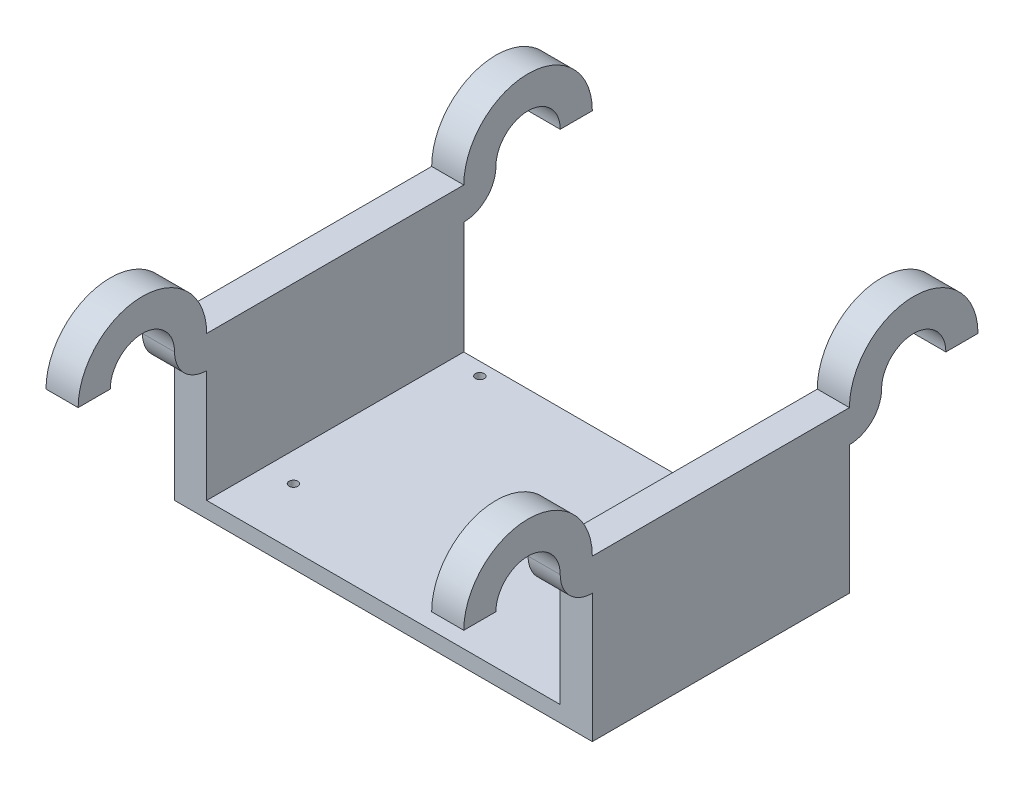
ISO-10303-21;
HEADER;
FILE_DESCRIPTION(('STEP AP214'),'2;1');
FILE_NAME('part.step','',(''),(''),'','','');
FILE_SCHEMA(('AUTOMOTIVE_DESIGN { 1 0 10303 214 1 1 1 1 }'));
ENDSEC;
DATA;
#1=APPLICATION_CONTEXT('core data for automotive mechanical design processes');
#2=APPLICATION_PROTOCOL_DEFINITION('international standard','automotive_design',2000,#1);
#3=PRODUCT_CONTEXT('',#1,'mechanical');
#4=PRODUCT('Part','Part','',(#3));
#5=PRODUCT_RELATED_PRODUCT_CATEGORY('part','',(#4));
#6=PRODUCT_DEFINITION_FORMATION('','',#4);
#7=PRODUCT_DEFINITION_CONTEXT('part definition',#1,'design');
#8=PRODUCT_DEFINITION('design','',#6,#7);
#9=PRODUCT_DEFINITION_SHAPE('','',#8);
#10=(LENGTH_UNIT() NAMED_UNIT(*) SI_UNIT(.MILLI.,.METRE.));
#11=(NAMED_UNIT(*) PLANE_ANGLE_UNIT() SI_UNIT($,.RADIAN.));
#12=(NAMED_UNIT(*) SI_UNIT($,.STERADIAN.) SOLID_ANGLE_UNIT());
#13=UNCERTAINTY_MEASURE_WITH_UNIT(LENGTH_MEASURE(1.E-05),#10,'distance_accuracy_value','');
#14=(GEOMETRIC_REPRESENTATION_CONTEXT(3) GLOBAL_UNCERTAINTY_ASSIGNED_CONTEXT((#13)) GLOBAL_UNIT_ASSIGNED_CONTEXT((#10,
#11,#12)) REPRESENTATION_CONTEXT('',''));
#15=CARTESIAN_POINT('',(0.,0.,0.));
#16=DIRECTION('',(0.,0.,1.));
#17=DIRECTION('',(1.,0.,0.));
#18=AXIS2_PLACEMENT_3D('',#15,#16,#17);
#19=CARTESIAN_POINT('',(-65.,5.,40.));
#20=DIRECTION('',(0.,0.,-1.));
#21=DIRECTION('',(-1.,0.,0.));
#22=AXIS2_PLACEMENT_3D('',#19,#20,#21);
#23=PLANE('',#22);
#24=DIRECTION('',(0.,-1.,0.));
#25=VECTOR('',#24,1.);
#26=CARTESIAN_POINT('',(65.,5.,40.));
#27=LINE('',#26,#25);
#28=CARTESIAN_POINT('',(65.,40.,40.));
#29=VERTEX_POINT('',#28);
#30=CARTESIAN_POINT('',(65.,0.,40.));
#31=VERTEX_POINT('',#30);
#32=EDGE_CURVE('E395',#29,#31,#27,.T.);
#33=ORIENTED_EDGE('',*,*,#32,.F.);
#34=DIRECTION('',(1.,0.,0.));
#35=VECTOR('',#34,1.);
#36=CARTESIAN_POINT('',(5.00000000000003,40.,40.));
#37=LINE('',#36,#35);
#38=CARTESIAN_POINT('',(55.,40.,40.));
#39=VERTEX_POINT('',#38);
#40=EDGE_CURVE('E268',#39,#29,#37,.T.);
#41=ORIENTED_EDGE('',*,*,#40,.F.);
#42=DIRECTION('',(0.,-1.,0.));
#43=VECTOR('',#42,1.);
#44=CARTESIAN_POINT('',(55.,50.,40.));
#45=LINE('',#44,#43);
#46=CARTESIAN_POINT('',(55.,5.,40.));
#47=VERTEX_POINT('',#46);
#48=EDGE_CURVE('E384',#39,#47,#45,.T.);
#49=ORIENTED_EDGE('',*,*,#48,.T.);
#50=DIRECTION('',(1.,0.,0.));
#51=VECTOR('',#50,1.);
#52=CARTESIAN_POINT('',(-65.,5.,40.));
#53=LINE('',#52,#51);
#54=CARTESIAN_POINT('',(-55.,5.,40.));
#55=VERTEX_POINT('',#54);
#56=EDGE_CURVE('E391',#55,#47,#53,.T.);
#57=ORIENTED_EDGE('',*,*,#56,.F.);
#58=DIRECTION('',(0.,-1.,0.));
#59=VECTOR('',#58,1.);
#60=CARTESIAN_POINT('',(-55.,50.,40.));
#61=LINE('',#60,#59);
#62=CARTESIAN_POINT('',(-55.,40.,40.));
#63=VERTEX_POINT('',#62);
#64=EDGE_CURVE('E372',#63,#55,#61,.T.);
#65=ORIENTED_EDGE('',*,*,#64,.F.);
#66=DIRECTION('',(-1.,0.,0.));
#67=VECTOR('',#66,1.);
#68=CARTESIAN_POINT('',(-5.,40.,40.));
#69=LINE('',#68,#67);
#70=CARTESIAN_POINT('',(-65.,40.,40.));
#71=VERTEX_POINT('',#70);
#72=EDGE_CURVE('E296',#63,#71,#69,.T.);
#73=ORIENTED_EDGE('',*,*,#72,.T.);
#74=DIRECTION('',(0.,-1.,0.));
#75=VECTOR('',#74,1.);
#76=CARTESIAN_POINT('',(-65.,5.,40.));
#77=LINE('',#76,#75);
#78=CARTESIAN_POINT('',(-65.,0.,40.));
#79=VERTEX_POINT('',#78);
#80=EDGE_CURVE('E406',#71,#79,#77,.T.);
#81=ORIENTED_EDGE('',*,*,#80,.T.);
#82=DIRECTION('',(1.,0.,0.));
#83=VECTOR('',#82,1.);
#84=CARTESIAN_POINT('',(-65.,0.,40.));
#85=LINE('',#84,#83);
#86=EDGE_CURVE('E392',#79,#31,#85,.T.);
#87=ORIENTED_EDGE('',*,*,#86,.T.);
#88=EDGE_LOOP('',(#33,#41,#49,#57,#65,#73,#81,#87));
#89=FACE_BOUND('',#88,.T.);
#90=ADVANCED_FACE('F39',(#89),#23,.F.);
#91=CARTESIAN_POINT('',(0.,5.,0.));
#92=DIRECTION('',(0.,-1.,0.));
#93=DIRECTION('',(0.,0.,-1.));
#94=AXIS2_PLACEMENT_3D('',#91,#92,#93);
#95=PLANE('',#94);
#96=CARTESIAN_POINT('',(40.,5.,22.));
#97=DIRECTION('',(0.,-1.,0.));
#98=DIRECTION('',(0.,0.,-1.));
#99=AXIS2_PLACEMENT_3D('',#96,#97,#98);
#100=CIRCLE('',#99,1.375);
#101=CARTESIAN_POINT('',(40.,5.,20.625));
#102=VERTEX_POINT('',#101);
#103=EDGE_CURVE('E347',#102,#102,#100,.T.);
#104=ORIENTED_EDGE('',*,*,#103,.T.);
#105=EDGE_LOOP('',(#104));
#106=FACE_BOUND('',#105,.T.);
#107=CARTESIAN_POINT('',(40.,5.,-36.));
#108=DIRECTION('',(0.,-1.,0.));
#109=DIRECTION('',(0.,0.,-1.));
#110=AXIS2_PLACEMENT_3D('',#107,#108,#109);
#111=CIRCLE('',#110,1.375);
#112=CARTESIAN_POINT('',(40.,5.,-37.375));
#113=VERTEX_POINT('',#112);
#114=EDGE_CURVE('E344',#113,#113,#111,.T.);
#115=ORIENTED_EDGE('',*,*,#114,.T.);
#116=EDGE_LOOP('',(#115));
#117=FACE_BOUND('',#116,.T.);
#118=CARTESIAN_POINT('',(-46.,5.,-36.));
#119=DIRECTION('',(0.,-1.,0.));
#120=DIRECTION('',(0.,0.,-1.));
#121=AXIS2_PLACEMENT_3D('',#118,#119,#120);
#122=CIRCLE('',#121,1.375);
#123=CARTESIAN_POINT('',(-46.,5.,-37.375));
#124=VERTEX_POINT('',#123);
#125=EDGE_CURVE('E336',#124,#124,#122,.T.);
#126=ORIENTED_EDGE('',*,*,#125,.T.);
#127=EDGE_LOOP('',(#126));
#128=FACE_BOUND('',#127,.T.);
#129=CARTESIAN_POINT('',(-46.,5.,22.));
#130=DIRECTION('',(0.,-1.,0.));
#131=DIRECTION('',(0.,0.,-1.));
#132=AXIS2_PLACEMENT_3D('',#129,#130,#131);
#133=CIRCLE('',#132,1.375);
#134=CARTESIAN_POINT('',(-46.,5.,20.625));
#135=VERTEX_POINT('',#134);
#136=EDGE_CURVE('E353',#135,#135,#133,.T.);
#137=ORIENTED_EDGE('',*,*,#136,.T.);
#138=EDGE_LOOP('',(#137));
#139=FACE_BOUND('',#138,.T.);
#140=DIRECTION('',(0.,0.,-1.));
#141=VECTOR('',#140,1.);
#142=CARTESIAN_POINT('',(-55.,5.,40.));
#143=LINE('',#142,#141);
#144=CARTESIAN_POINT('',(-55.,5.,-40.));
#145=VERTEX_POINT('',#144);
#146=EDGE_CURVE('E356',#55,#145,#143,.T.);
#147=ORIENTED_EDGE('',*,*,#146,.F.);
#148=ORIENTED_EDGE('',*,*,#56,.T.);
#149=DIRECTION('',(0.,0.,1.));
#150=VECTOR('',#149,1.);
#151=CARTESIAN_POINT('',(55.,5.,-40.));
#152=LINE('',#151,#150);
#153=CARTESIAN_POINT('',(55.,5.,-40.));
#154=VERTEX_POINT('',#153);
#155=EDGE_CURVE('E374',#154,#47,#152,.T.);
#156=ORIENTED_EDGE('',*,*,#155,.F.);
#157=DIRECTION('',(-1.,0.,0.));
#158=VECTOR('',#157,1.);
#159=CARTESIAN_POINT('',(-65.,5.,-40.));
#160=LINE('',#159,#158);
#161=EDGE_CURVE('E389',#154,#145,#160,.T.);
#162=ORIENTED_EDGE('',*,*,#161,.T.);
#163=EDGE_LOOP('',(#147,#148,#156,#162));
#164=FACE_BOUND('',#163,.T.);
#165=ADVANCED_FACE('F465',(#106,#117,#128,#139,#164),#95,.F.);
#166=CARTESIAN_POINT('',(65.,5.,40.));
#167=DIRECTION('',(-1.,0.,0.));
#168=DIRECTION('',(0.,0.,1.));
#169=AXIS2_PLACEMENT_3D('',#166,#167,#168);
#170=PLANE('',#169);
#171=DIRECTION('',(0.,0.,-1.));
#172=VECTOR('',#171,1.);
#173=CARTESIAN_POINT('',(65.,0.,40.));
#174=LINE('',#173,#172);
#175=CARTESIAN_POINT('',(65.,0.,-40.));
#176=VERTEX_POINT('',#175);
#177=EDGE_CURVE('E388',#31,#176,#174,.T.);
#178=ORIENTED_EDGE('',*,*,#177,.T.);
#179=DIRECTION('',(0.,-1.,0.));
#180=VECTOR('',#179,1.);
#181=CARTESIAN_POINT('',(65.,5.,-40.));
#182=LINE('',#181,#180);
#183=CARTESIAN_POINT('',(65.,40.,-40.));
#184=VERTEX_POINT('',#183);
#185=EDGE_CURVE('E11',#184,#176,#182,.T.);
#186=ORIENTED_EDGE('',*,*,#185,.F.);
#187=CARTESIAN_POINT('',(65.,50.,-40.));
#188=DIRECTION('',(1.,0.,0.));
#189=DIRECTION('',(0.,0.,-1.));
#190=AXIS2_PLACEMENT_3D('',#187,#188,#189);
#191=CIRCLE('',#190,9.99999999999999);
#192=CARTESIAN_POINT('',(65.,50.,-50.));
#193=VERTEX_POINT('',#192);
#194=EDGE_CURVE('E222',#184,#193,#191,.T.);
#195=ORIENTED_EDGE('',*,*,#194,.T.);
#196=CARTESIAN_POINT('',(65.,50.,-60.));
#197=DIRECTION('',(1.,0.,0.));
#198=DIRECTION('',(0.,0.,-1.));
#199=AXIS2_PLACEMENT_3D('',#196,#197,#198);
#200=CIRCLE('',#199,10.);
#201=CARTESIAN_POINT('',(65.,50.,-70.));
#202=VERTEX_POINT('',#201);
#203=EDGE_CURVE('E212',#202,#193,#200,.T.);
#204=ORIENTED_EDGE('',*,*,#203,.F.);
#205=DIRECTION('',(0.,0.,-1.));
#206=VECTOR('',#205,1.);
#207=CARTESIAN_POINT('',(65.,50.,0.));
#208=LINE('',#207,#206);
#209=CARTESIAN_POINT('',(65.,50.,-80.));
#210=VERTEX_POINT('',#209);
#211=EDGE_CURVE('E208',#202,#210,#208,.T.);
#212=ORIENTED_EDGE('',*,*,#211,.T.);
#213=CARTESIAN_POINT('',(65.,50.,-60.));
#214=DIRECTION('',(1.,0.,0.));
#215=DIRECTION('',(0.,0.,-1.));
#216=AXIS2_PLACEMENT_3D('',#213,#214,#215);
#217=CIRCLE('',#216,20.);
#218=CARTESIAN_POINT('',(65.,50.,-40.));
#219=VERTEX_POINT('',#218);
#220=EDGE_CURVE('E215',#210,#219,#217,.T.);
#221=ORIENTED_EDGE('',*,*,#220,.T.);
#222=DIRECTION('',(0.,0.,-1.));
#223=VECTOR('',#222,1.);
#224=CARTESIAN_POINT('',(65.,50.,-40.));
#225=LINE('',#224,#223);
#226=CARTESIAN_POINT('',(65.,50.,40.));
#227=VERTEX_POINT('',#226);
#228=EDGE_CURVE('E375',#227,#219,#225,.T.);
#229=ORIENTED_EDGE('',*,*,#228,.F.);
#230=CARTESIAN_POINT('',(65.,50.,60.));
#231=DIRECTION('',(1.,0.,0.));
#232=DIRECTION('',(0.,0.,-1.));
#233=AXIS2_PLACEMENT_3D('',#230,#231,#232);
#234=CIRCLE('',#233,20.);
#235=CARTESIAN_POINT('',(65.,50.,80.));
#236=VERTEX_POINT('',#235);
#237=EDGE_CURVE('E258',#227,#236,#234,.T.);
#238=ORIENTED_EDGE('',*,*,#237,.T.);
#239=DIRECTION('',(0.,0.,-1.));
#240=VECTOR('',#239,1.);
#241=CARTESIAN_POINT('',(65.,50.,0.));
#242=LINE('',#241,#240);
#243=CARTESIAN_POINT('',(65.,50.,70.));
#244=VERTEX_POINT('',#243);
#245=EDGE_CURVE('E261',#236,#244,#242,.T.);
#246=ORIENTED_EDGE('',*,*,#245,.T.);
#247=CARTESIAN_POINT('',(65.,50.,60.));
#248=DIRECTION('',(1.,0.,0.));
#249=DIRECTION('',(0.,0.,-1.));
#250=AXIS2_PLACEMENT_3D('',#247,#248,#249);
#251=CIRCLE('',#250,10.);
#252=CARTESIAN_POINT('',(65.,50.,50.));
#253=VERTEX_POINT('',#252);
#254=EDGE_CURVE('E243',#253,#244,#251,.T.);
#255=ORIENTED_EDGE('',*,*,#254,.F.);
#256=CARTESIAN_POINT('',(65.,50.,40.));
#257=DIRECTION('',(1.,0.,0.));
#258=DIRECTION('',(0.,0.,-1.));
#259=AXIS2_PLACEMENT_3D('',#256,#257,#258);
#260=CIRCLE('',#259,9.99999999999999);
#261=EDGE_CURVE('E255',#253,#29,#260,.T.);
#262=ORIENTED_EDGE('',*,*,#261,.T.);
#263=ORIENTED_EDGE('',*,*,#32,.T.);
#264=EDGE_LOOP('',(#178,#186,#195,#204,#212,#221,#229,#238,#246,#255,#262,#263));
#265=FACE_BOUND('',#264,.T.);
#266=ADVANCED_FACE('F41',(#265),#170,.F.);
#267=CARTESIAN_POINT('',(-65.,5.,-40.));
#268=DIRECTION('',(0.,0.,1.));
#269=DIRECTION('',(1.,0.,0.));
#270=AXIS2_PLACEMENT_3D('',#267,#268,#269);
#271=PLANE('',#270);
#272=DIRECTION('',(0.,-1.,0.));
#273=VECTOR('',#272,1.);
#274=CARTESIAN_POINT('',(55.,50.,-40.));
#275=LINE('',#274,#273);
#276=CARTESIAN_POINT('',(55.,40.,-40.));
#277=VERTEX_POINT('',#276);
#278=EDGE_CURVE('E62',#277,#154,#275,.T.);
#279=ORIENTED_EDGE('',*,*,#278,.F.);
#280=DIRECTION('',(1.,0.,0.));
#281=VECTOR('',#280,1.);
#282=CARTESIAN_POINT('',(5.00000000000003,40.,-40.));
#283=LINE('',#282,#281);
#284=EDGE_CURVE('E211',#277,#184,#283,.T.);
#285=ORIENTED_EDGE('',*,*,#284,.T.);
#286=ORIENTED_EDGE('',*,*,#185,.T.);
#287=DIRECTION('',(-1.,0.,0.));
#288=VECTOR('',#287,1.);
#289=CARTESIAN_POINT('',(-65.,0.,-40.));
#290=LINE('',#289,#288);
#291=CARTESIAN_POINT('',(-65.,0.,-40.));
#292=VERTEX_POINT('',#291);
#293=EDGE_CURVE('E397',#176,#292,#290,.T.);
#294=ORIENTED_EDGE('',*,*,#293,.T.);
#295=DIRECTION('',(0.,-1.,0.));
#296=VECTOR('',#295,1.);
#297=CARTESIAN_POINT('',(-65.,5.,-40.));
#298=LINE('',#297,#296);
#299=CARTESIAN_POINT('',(-65.,40.,-40.));
#300=VERTEX_POINT('',#299);
#301=EDGE_CURVE('E47',#300,#292,#298,.T.);
#302=ORIENTED_EDGE('',*,*,#301,.F.);
#303=DIRECTION('',(-1.,0.,0.));
#304=VECTOR('',#303,1.);
#305=CARTESIAN_POINT('',(-5.,40.,-40.));
#306=LINE('',#305,#304);
#307=CARTESIAN_POINT('',(-55.,40.,-40.));
#308=VERTEX_POINT('',#307);
#309=EDGE_CURVE('E328',#308,#300,#306,.T.);
#310=ORIENTED_EDGE('',*,*,#309,.F.);
#311=DIRECTION('',(0.,-1.,0.));
#312=VECTOR('',#311,1.);
#313=CARTESIAN_POINT('',(-55.,50.,-40.));
#314=LINE('',#313,#312);
#315=EDGE_CURVE('E54',#308,#145,#314,.T.);
#316=ORIENTED_EDGE('',*,*,#315,.T.);
#317=ORIENTED_EDGE('',*,*,#161,.F.);
#318=EDGE_LOOP('',(#279,#285,#286,#294,#302,#310,#316,#317));
#319=FACE_BOUND('',#318,.T.);
#320=ADVANCED_FACE('F416',(#319),#271,.F.);
#321=CARTESIAN_POINT('',(-65.,5.,40.));
#322=DIRECTION('',(1.,0.,0.));
#323=DIRECTION('',(0.,0.,-1.));
#324=AXIS2_PLACEMENT_3D('',#321,#322,#323);
#325=PLANE('',#324);
#326=DIRECTION('',(0.,0.,1.));
#327=VECTOR('',#326,1.);
#328=CARTESIAN_POINT('',(-65.,0.,40.));
#329=LINE('',#328,#327);
#330=EDGE_CURVE('E400',#292,#79,#329,.T.);
#331=ORIENTED_EDGE('',*,*,#330,.T.);
#332=ORIENTED_EDGE('',*,*,#80,.F.);
#333=CARTESIAN_POINT('',(-65.,50.,40.));
#334=DIRECTION('',(-1.,0.,0.));
#335=DIRECTION('',(0.,0.,1.));
#336=AXIS2_PLACEMENT_3D('',#333,#334,#335);
#337=CIRCLE('',#336,9.99999999999999);
#338=CARTESIAN_POINT('',(-65.,50.,50.));
#339=VERTEX_POINT('',#338);
#340=EDGE_CURVE('E288',#339,#71,#337,.F.);
#341=ORIENTED_EDGE('',*,*,#340,.F.);
#342=CARTESIAN_POINT('',(-65.,50.,60.));
#343=DIRECTION('',(-1.,0.,0.));
#344=DIRECTION('',(0.,0.,1.));
#345=AXIS2_PLACEMENT_3D('',#342,#343,#344);
#346=CIRCLE('',#345,10.);
#347=CARTESIAN_POINT('',(-65.,50.,70.));
#348=VERTEX_POINT('',#347);
#349=EDGE_CURVE('E290',#348,#339,#346,.T.);
#350=ORIENTED_EDGE('',*,*,#349,.F.);
#351=DIRECTION('',(0.,0.,-1.));
#352=VECTOR('',#351,1.);
#353=CARTESIAN_POINT('',(-65.,50.,0.));
#354=LINE('',#353,#352);
#355=CARTESIAN_POINT('',(-65.,50.,80.));
#356=VERTEX_POINT('',#355);
#357=EDGE_CURVE('E293',#356,#348,#354,.T.);
#358=ORIENTED_EDGE('',*,*,#357,.F.);
#359=CARTESIAN_POINT('',(-65.,50.,60.));
#360=DIRECTION('',(-1.,0.,0.));
#361=DIRECTION('',(0.,0.,1.));
#362=AXIS2_PLACEMENT_3D('',#359,#360,#361);
#363=CIRCLE('',#362,20.);
#364=CARTESIAN_POINT('',(-65.,50.,40.));
#365=VERTEX_POINT('',#364);
#366=EDGE_CURVE('E272',#365,#356,#363,.F.);
#367=ORIENTED_EDGE('',*,*,#366,.F.);
#368=DIRECTION('',(0.,0.,1.));
#369=VECTOR('',#368,1.);
#370=CARTESIAN_POINT('',(-65.,50.,40.));
#371=LINE('',#370,#369);
#372=CARTESIAN_POINT('',(-65.,50.,-40.));
#373=VERTEX_POINT('',#372);
#374=EDGE_CURVE('E357',#373,#365,#371,.T.);
#375=ORIENTED_EDGE('',*,*,#374,.F.);
#376=CARTESIAN_POINT('',(-65.,50.,-60.));
#377=DIRECTION('',(-1.,0.,0.));
#378=DIRECTION('',(0.,0.,1.));
#379=AXIS2_PLACEMENT_3D('',#376,#377,#378);
#380=CIRCLE('',#379,20.);
#381=CARTESIAN_POINT('',(-65.,50.,-80.));
#382=VERTEX_POINT('',#381);
#383=EDGE_CURVE('E318',#373,#382,#380,.T.);
#384=ORIENTED_EDGE('',*,*,#383,.T.);
#385=DIRECTION('',(0.,0.,1.));
#386=VECTOR('',#385,1.);
#387=CARTESIAN_POINT('',(-65.,50.,0.));
#388=LINE('',#387,#386);
#389=CARTESIAN_POINT('',(-65.,50.,-70.));
#390=VERTEX_POINT('',#389);
#391=EDGE_CURVE('E321',#382,#390,#388,.T.);
#392=ORIENTED_EDGE('',*,*,#391,.T.);
#393=CARTESIAN_POINT('',(-65.,50.,-60.));
#394=DIRECTION('',(-1.,0.,0.));
#395=DIRECTION('',(0.,0.,1.));
#396=AXIS2_PLACEMENT_3D('',#393,#394,#395);
#397=CIRCLE('',#396,10.);
#398=CARTESIAN_POINT('',(-65.,50.,-50.));
#399=VERTEX_POINT('',#398);
#400=EDGE_CURVE('E285',#399,#390,#397,.T.);
#401=ORIENTED_EDGE('',*,*,#400,.F.);
#402=CARTESIAN_POINT('',(-65.,50.,-40.));
#403=DIRECTION('',(-1.,0.,0.));
#404=DIRECTION('',(0.,0.,1.));
#405=AXIS2_PLACEMENT_3D('',#402,#403,#404);
#406=CIRCLE('',#405,9.99999999999999);
#407=EDGE_CURVE('E315',#399,#300,#406,.T.);
#408=ORIENTED_EDGE('',*,*,#407,.T.);
#409=ORIENTED_EDGE('',*,*,#301,.T.);
#410=EDGE_LOOP('',(#331,#332,#341,#350,#358,#367,#375,#384,#392,#401,#408,#409));
#411=FACE_BOUND('',#410,.T.);
#412=ADVANCED_FACE('F409',(#411),#325,.F.);
#413=CARTESIAN_POINT('',(0.,0.,0.));
#414=DIRECTION('',(0.,-1.,0.));
#415=DIRECTION('',(0.,0.,-1.));
#416=AXIS2_PLACEMENT_3D('',#413,#414,#415);
#417=PLANE('',#416);
#418=CARTESIAN_POINT('',(40.,0.,22.));
#419=DIRECTION('',(0.,1.,0.));
#420=DIRECTION('',(0.,0.,1.));
#421=AXIS2_PLACEMENT_3D('',#418,#419,#420);
#422=CIRCLE('',#421,1.375);
#423=CARTESIAN_POINT('',(40.,0.,23.375));
#424=VERTEX_POINT('',#423);
#425=EDGE_CURVE('E333',#424,#424,#422,.T.);
#426=ORIENTED_EDGE('',*,*,#425,.T.);
#427=EDGE_LOOP('',(#426));
#428=FACE_BOUND('',#427,.T.);
#429=CARTESIAN_POINT('',(40.,0.,-36.));
#430=DIRECTION('',(0.,1.,0.));
#431=DIRECTION('',(0.,0.,1.));
#432=AXIS2_PLACEMENT_3D('',#429,#430,#431);
#433=CIRCLE('',#432,1.375);
#434=CARTESIAN_POINT('',(40.,0.,-34.625));
#435=VERTEX_POINT('',#434);
#436=EDGE_CURVE('E337',#435,#435,#433,.T.);
#437=ORIENTED_EDGE('',*,*,#436,.T.);
#438=EDGE_LOOP('',(#437));
#439=FACE_BOUND('',#438,.T.);
#440=CARTESIAN_POINT('',(-46.,0.,-36.));
#441=DIRECTION('',(0.,1.,0.));
#442=DIRECTION('',(0.,0.,1.));
#443=AXIS2_PLACEMENT_3D('',#440,#441,#442);
#444=CIRCLE('',#443,1.375);
#445=CARTESIAN_POINT('',(-46.,0.,-34.625));
#446=VERTEX_POINT('',#445);
#447=EDGE_CURVE('E332',#446,#446,#444,.T.);
#448=ORIENTED_EDGE('',*,*,#447,.T.);
#449=EDGE_LOOP('',(#448));
#450=FACE_BOUND('',#449,.T.);
#451=CARTESIAN_POINT('',(-46.,0.,22.));
#452=DIRECTION('',(0.,1.,0.));
#453=DIRECTION('',(0.,0.,1.));
#454=AXIS2_PLACEMENT_3D('',#451,#452,#453);
#455=CIRCLE('',#454,1.375);
#456=CARTESIAN_POINT('',(-46.,0.,23.375));
#457=VERTEX_POINT('',#456);
#458=EDGE_CURVE('E350',#457,#457,#455,.T.);
#459=ORIENTED_EDGE('',*,*,#458,.T.);
#460=EDGE_LOOP('',(#459));
#461=FACE_BOUND('',#460,.T.);
#462=ORIENTED_EDGE('',*,*,#177,.F.);
#463=ORIENTED_EDGE('',*,*,#86,.F.);
#464=ORIENTED_EDGE('',*,*,#330,.F.);
#465=ORIENTED_EDGE('',*,*,#293,.F.);
#466=EDGE_LOOP('',(#462,#463,#464,#465));
#467=FACE_BOUND('',#466,.T.);
#468=ADVANCED_FACE('F420',(#428,#439,#450,#461,#467),#417,.T.);
#469=CARTESIAN_POINT('',(55.,50.,-40.));
#470=DIRECTION('',(1.,0.,0.));
#471=DIRECTION('',(0.,0.,-1.));
#472=AXIS2_PLACEMENT_3D('',#469,#470,#471);
#473=PLANE('',#472);
#474=ORIENTED_EDGE('',*,*,#155,.T.);
#475=ORIENTED_EDGE('',*,*,#48,.F.);
#476=CARTESIAN_POINT('',(55.,50.,40.));
#477=DIRECTION('',(1.,0.,0.));
#478=DIRECTION('',(0.,0.,-1.));
#479=AXIS2_PLACEMENT_3D('',#476,#477,#478);
#480=CIRCLE('',#479,9.99999999999999);
#481=CARTESIAN_POINT('',(55.,50.,50.));
#482=VERTEX_POINT('',#481);
#483=EDGE_CURVE('E252',#39,#482,#480,.F.);
#484=ORIENTED_EDGE('',*,*,#483,.T.);
#485=CARTESIAN_POINT('',(55.,50.,60.));
#486=DIRECTION('',(1.,0.,0.));
#487=DIRECTION('',(0.,0.,-1.));
#488=AXIS2_PLACEMENT_3D('',#485,#486,#487);
#489=CIRCLE('',#488,10.);
#490=CARTESIAN_POINT('',(55.,50.,70.));
#491=VERTEX_POINT('',#490);
#492=EDGE_CURVE('E249',#491,#482,#489,.F.);
#493=ORIENTED_EDGE('',*,*,#492,.F.);
#494=DIRECTION('',(0.,0.,1.));
#495=VECTOR('',#494,1.);
#496=CARTESIAN_POINT('',(55.,50.,0.));
#497=LINE('',#496,#495);
#498=CARTESIAN_POINT('',(55.,50.,80.));
#499=VERTEX_POINT('',#498);
#500=EDGE_CURVE('E246',#491,#499,#497,.T.);
#501=ORIENTED_EDGE('',*,*,#500,.T.);
#502=CARTESIAN_POINT('',(55.,50.,60.));
#503=DIRECTION('',(1.,0.,0.));
#504=DIRECTION('',(0.,0.,-1.));
#505=AXIS2_PLACEMENT_3D('',#502,#503,#504);
#506=CIRCLE('',#505,20.);
#507=CARTESIAN_POINT('',(55.,50.,40.));
#508=VERTEX_POINT('',#507);
#509=EDGE_CURVE('E244',#499,#508,#506,.F.);
#510=ORIENTED_EDGE('',*,*,#509,.T.);
#511=DIRECTION('',(0.,0.,1.));
#512=VECTOR('',#511,1.);
#513=CARTESIAN_POINT('',(55.,50.,-40.));
#514=LINE('',#513,#512);
#515=CARTESIAN_POINT('',(55.,50.,-40.));
#516=VERTEX_POINT('',#515);
#517=EDGE_CURVE('E378',#516,#508,#514,.T.);
#518=ORIENTED_EDGE('',*,*,#517,.F.);
#519=CARTESIAN_POINT('',(55.,50.,-60.));
#520=DIRECTION('',(1.,0.,0.));
#521=DIRECTION('',(0.,0.,-1.));
#522=AXIS2_PLACEMENT_3D('',#519,#520,#521);
#523=CIRCLE('',#522,20.);
#524=CARTESIAN_POINT('',(55.,50.,-80.));
#525=VERTEX_POINT('',#524);
#526=EDGE_CURVE('E241',#516,#525,#523,.F.);
#527=ORIENTED_EDGE('',*,*,#526,.T.);
#528=DIRECTION('',(0.,0.,1.));
#529=VECTOR('',#528,1.);
#530=CARTESIAN_POINT('',(55.,50.,0.));
#531=LINE('',#530,#529);
#532=CARTESIAN_POINT('',(55.,50.,-70.));
#533=VERTEX_POINT('',#532);
#534=EDGE_CURVE('E209',#525,#533,#531,.T.);
#535=ORIENTED_EDGE('',*,*,#534,.T.);
#536=CARTESIAN_POINT('',(55.,50.,-60.));
#537=DIRECTION('',(1.,0.,0.));
#538=DIRECTION('',(0.,0.,-1.));
#539=AXIS2_PLACEMENT_3D('',#536,#537,#538);
#540=CIRCLE('',#539,10.);
#541=CARTESIAN_POINT('',(55.,50.,-50.));
#542=VERTEX_POINT('',#541);
#543=EDGE_CURVE('E492',#542,#533,#540,.F.);
#544=ORIENTED_EDGE('',*,*,#543,.F.);
#545=CARTESIAN_POINT('',(55.,50.,-40.));
#546=DIRECTION('',(1.,0.,0.));
#547=DIRECTION('',(0.,0.,-1.));
#548=AXIS2_PLACEMENT_3D('',#545,#546,#547);
#549=CIRCLE('',#548,9.99999999999999);
#550=EDGE_CURVE('E236',#542,#277,#549,.F.);
#551=ORIENTED_EDGE('',*,*,#550,.T.);
#552=ORIENTED_EDGE('',*,*,#278,.T.);
#553=EDGE_LOOP('',(#474,#475,#484,#493,#501,#510,#518,#527,#535,#544,#551,#552));
#554=FACE_BOUND('',#553,.T.);
#555=ADVANCED_FACE('F475',(#554),#473,.F.);
#556=CARTESIAN_POINT('',(0.,50.,0.));
#557=DIRECTION('',(0.,-1.,0.));
#558=DIRECTION('',(0.,0.,-1.));
#559=AXIS2_PLACEMENT_3D('',#556,#557,#558);
#560=PLANE('',#559);
#561=ORIENTED_EDGE('',*,*,#228,.T.);
#562=DIRECTION('',(-1.,0.,0.));
#563=VECTOR('',#562,1.);
#564=CARTESIAN_POINT('',(65.,50.,-40.));
#565=LINE('',#564,#563);
#566=EDGE_CURVE('E218',#219,#516,#565,.T.);
#567=ORIENTED_EDGE('',*,*,#566,.T.);
#568=ORIENTED_EDGE('',*,*,#517,.T.);
#569=DIRECTION('',(1.,0.,0.));
#570=VECTOR('',#569,1.);
#571=CARTESIAN_POINT('',(65.,50.,40.));
#572=LINE('',#571,#570);
#573=EDGE_CURVE('E381',#508,#227,#572,.T.);
#574=ORIENTED_EDGE('',*,*,#573,.T.);
#575=EDGE_LOOP('',(#561,#567,#568,#574));
#576=FACE_BOUND('',#575,.T.);
#577=ADVANCED_FACE('F490',(#576),#560,.F.);
#578=CARTESIAN_POINT('',(-55.,50.,40.));
#579=DIRECTION('',(-1.,0.,0.));
#580=DIRECTION('',(0.,0.,1.));
#581=AXIS2_PLACEMENT_3D('',#578,#579,#580);
#582=PLANE('',#581);
#583=ORIENTED_EDGE('',*,*,#146,.T.);
#584=ORIENTED_EDGE('',*,*,#315,.F.);
#585=CARTESIAN_POINT('',(-55.,50.,-40.));
#586=DIRECTION('',(-1.,0.,0.));
#587=DIRECTION('',(0.,0.,1.));
#588=AXIS2_PLACEMENT_3D('',#585,#586,#587);
#589=CIRCLE('',#588,9.99999999999999);
#590=CARTESIAN_POINT('',(-55.,50.,-50.));
#591=VERTEX_POINT('',#590);
#592=EDGE_CURVE('E312',#308,#591,#589,.F.);
#593=ORIENTED_EDGE('',*,*,#592,.T.);
#594=CARTESIAN_POINT('',(-55.,50.,-60.));
#595=DIRECTION('',(-1.,0.,0.));
#596=DIRECTION('',(0.,0.,1.));
#597=AXIS2_PLACEMENT_3D('',#594,#595,#596);
#598=CIRCLE('',#597,10.);
#599=CARTESIAN_POINT('',(-55.,50.,-70.));
#600=VERTEX_POINT('',#599);
#601=EDGE_CURVE('E309',#600,#591,#598,.F.);
#602=ORIENTED_EDGE('',*,*,#601,.F.);
#603=DIRECTION('',(0.,0.,-1.));
#604=VECTOR('',#603,1.);
#605=CARTESIAN_POINT('',(-55.,50.,0.));
#606=LINE('',#605,#604);
#607=CARTESIAN_POINT('',(-55.,50.,-80.));
#608=VERTEX_POINT('',#607);
#609=EDGE_CURVE('E306',#600,#608,#606,.T.);
#610=ORIENTED_EDGE('',*,*,#609,.T.);
#611=CARTESIAN_POINT('',(-55.,50.,-60.));
#612=DIRECTION('',(-1.,0.,0.));
#613=DIRECTION('',(0.,0.,1.));
#614=AXIS2_PLACEMENT_3D('',#611,#612,#613);
#615=CIRCLE('',#614,20.);
#616=CARTESIAN_POINT('',(-55.,50.,-40.));
#617=VERTEX_POINT('',#616);
#618=EDGE_CURVE('E304',#608,#617,#615,.F.);
#619=ORIENTED_EDGE('',*,*,#618,.T.);
#620=DIRECTION('',(0.,0.,-1.));
#621=VECTOR('',#620,1.);
#622=CARTESIAN_POINT('',(-55.,50.,40.));
#623=LINE('',#622,#621);
#624=CARTESIAN_POINT('',(-55.,50.,40.));
#625=VERTEX_POINT('',#624);
#626=EDGE_CURVE('E363',#625,#617,#623,.T.);
#627=ORIENTED_EDGE('',*,*,#626,.F.);
#628=CARTESIAN_POINT('',(-55.,50.,60.));
#629=DIRECTION('',(-1.,0.,0.));
#630=DIRECTION('',(0.,0.,1.));
#631=AXIS2_PLACEMENT_3D('',#628,#629,#630);
#632=CIRCLE('',#631,20.);
#633=CARTESIAN_POINT('',(-55.,50.,80.));
#634=VERTEX_POINT('',#633);
#635=EDGE_CURVE('E283',#634,#625,#632,.T.);
#636=ORIENTED_EDGE('',*,*,#635,.F.);
#637=DIRECTION('',(0.,0.,1.));
#638=VECTOR('',#637,1.);
#639=CARTESIAN_POINT('',(-55.,50.,0.));
#640=LINE('',#639,#638);
#641=CARTESIAN_POINT('',(-55.,50.,70.));
#642=VERTEX_POINT('',#641);
#643=EDGE_CURVE('E280',#642,#634,#640,.T.);
#644=ORIENTED_EDGE('',*,*,#643,.F.);
#645=CARTESIAN_POINT('',(-55.,50.,60.));
#646=DIRECTION('',(-1.,0.,0.));
#647=DIRECTION('',(0.,0.,1.));
#648=AXIS2_PLACEMENT_3D('',#645,#646,#647);
#649=CIRCLE('',#648,10.);
#650=CARTESIAN_POINT('',(-55.,50.,50.));
#651=VERTEX_POINT('',#650);
#652=EDGE_CURVE('E276',#651,#642,#649,.F.);
#653=ORIENTED_EDGE('',*,*,#652,.F.);
#654=CARTESIAN_POINT('',(-55.,50.,40.));
#655=DIRECTION('',(-1.,0.,0.));
#656=DIRECTION('',(0.,0.,1.));
#657=AXIS2_PLACEMENT_3D('',#654,#655,#656);
#658=CIRCLE('',#657,9.99999999999999);
#659=EDGE_CURVE('E273',#63,#651,#658,.T.);
#660=ORIENTED_EDGE('',*,*,#659,.F.);
#661=ORIENTED_EDGE('',*,*,#64,.T.);
#662=EDGE_LOOP('',(#583,#584,#593,#602,#610,#619,#627,#636,#644,#653,#660,#661));
#663=FACE_BOUND('',#662,.T.);
#664=ADVANCED_FACE('F446',(#663),#582,.F.);
#665=CARTESIAN_POINT('',(0.,50.,0.));
#666=DIRECTION('',(0.,-1.,0.));
#667=DIRECTION('',(0.,0.,-1.));
#668=AXIS2_PLACEMENT_3D('',#665,#666,#667);
#669=PLANE('',#668);
#670=ORIENTED_EDGE('',*,*,#374,.T.);
#671=DIRECTION('',(1.,0.,0.));
#672=VECTOR('',#671,1.);
#673=CARTESIAN_POINT('',(-65.,50.,40.));
#674=LINE('',#673,#672);
#675=EDGE_CURVE('E360',#365,#625,#674,.T.);
#676=ORIENTED_EDGE('',*,*,#675,.T.);
#677=ORIENTED_EDGE('',*,*,#626,.T.);
#678=DIRECTION('',(-1.,0.,0.));
#679=VECTOR('',#678,1.);
#680=CARTESIAN_POINT('',(-65.,50.,-40.));
#681=LINE('',#680,#679);
#682=EDGE_CURVE('E366',#617,#373,#681,.T.);
#683=ORIENTED_EDGE('',*,*,#682,.T.);
#684=EDGE_LOOP('',(#670,#676,#677,#683));
#685=FACE_BOUND('',#684,.T.);
#686=ADVANCED_FACE('F444',(#685),#669,.F.);
#687=CARTESIAN_POINT('',(-46.,0.,22.));
#688=DIRECTION('',(0.,1.,0.));
#689=DIRECTION('',(0.,0.,1.));
#690=AXIS2_PLACEMENT_3D('',#687,#688,#689);
#691=CYLINDRICAL_SURFACE('',#690,1.375);
#692=ORIENTED_EDGE('',*,*,#458,.F.);
#693=EDGE_LOOP('',(#692));
#694=FACE_BOUND('',#693,.T.);
#695=ORIENTED_EDGE('',*,*,#136,.F.);
#696=EDGE_LOOP('',(#695));
#697=FACE_BOUND('',#696,.T.);
#698=ADVANCED_FACE('F542',(#694,#697),#691,.F.);
#699=CARTESIAN_POINT('',(-46.,0.,-36.));
#700=DIRECTION('',(0.,1.,0.));
#701=DIRECTION('',(0.,0.,1.));
#702=AXIS2_PLACEMENT_3D('',#699,#700,#701);
#703=CYLINDRICAL_SURFACE('',#702,1.375);
#704=ORIENTED_EDGE('',*,*,#447,.F.);
#705=EDGE_LOOP('',(#704));
#706=FACE_BOUND('',#705,.T.);
#707=ORIENTED_EDGE('',*,*,#125,.F.);
#708=EDGE_LOOP('',(#707));
#709=FACE_BOUND('',#708,.T.);
#710=ADVANCED_FACE('F547',(#706,#709),#703,.F.);
#711=CARTESIAN_POINT('',(40.,0.,-36.));
#712=DIRECTION('',(0.,1.,0.));
#713=DIRECTION('',(0.,0.,1.));
#714=AXIS2_PLACEMENT_3D('',#711,#712,#713);
#715=CYLINDRICAL_SURFACE('',#714,1.375);
#716=ORIENTED_EDGE('',*,*,#436,.F.);
#717=EDGE_LOOP('',(#716));
#718=FACE_BOUND('',#717,.T.);
#719=ORIENTED_EDGE('',*,*,#114,.F.);
#720=EDGE_LOOP('',(#719));
#721=FACE_BOUND('',#720,.T.);
#722=ADVANCED_FACE('F559',(#718,#721),#715,.F.);
#723=CARTESIAN_POINT('',(40.,0.,22.));
#724=DIRECTION('',(0.,1.,0.));
#725=DIRECTION('',(0.,0.,1.));
#726=AXIS2_PLACEMENT_3D('',#723,#724,#725);
#727=CYLINDRICAL_SURFACE('',#726,1.375);
#728=ORIENTED_EDGE('',*,*,#425,.F.);
#729=EDGE_LOOP('',(#728));
#730=FACE_BOUND('',#729,.T.);
#731=ORIENTED_EDGE('',*,*,#103,.F.);
#732=EDGE_LOOP('',(#731));
#733=FACE_BOUND('',#732,.T.);
#734=ADVANCED_FACE('F569',(#730,#733),#727,.F.);
#735=CARTESIAN_POINT('',(-5.,50.,-60.));
#736=DIRECTION('',(-1.,0.,0.));
#737=DIRECTION('',(0.,0.,1.));
#738=AXIS2_PLACEMENT_3D('',#735,#736,#737);
#739=CYLINDRICAL_SURFACE('',#738,10.);
#740=DIRECTION('',(-1.,0.,0.));
#741=VECTOR('',#740,1.);
#742=CARTESIAN_POINT('',(-5.,50.,-70.));
#743=LINE('',#742,#741);
#744=EDGE_CURVE('E307',#600,#390,#743,.T.);
#745=ORIENTED_EDGE('',*,*,#744,.F.);
#746=ORIENTED_EDGE('',*,*,#601,.T.);
#747=DIRECTION('',(-1.,0.,0.));
#748=VECTOR('',#747,1.);
#749=CARTESIAN_POINT('',(-5.,50.,-50.));
#750=LINE('',#749,#748);
#751=EDGE_CURVE('E324',#591,#399,#750,.T.);
#752=ORIENTED_EDGE('',*,*,#751,.T.);
#753=ORIENTED_EDGE('',*,*,#400,.T.);
#754=EDGE_LOOP('',(#745,#746,#752,#753));
#755=FACE_BOUND('',#754,.T.);
#756=ADVANCED_FACE('F458',(#755),#739,.F.);
#757=CARTESIAN_POINT('',(-5.,50.,0.));
#758=DIRECTION('',(0.,-1.,0.));
#759=DIRECTION('',(0.,0.,-1.));
#760=AXIS2_PLACEMENT_3D('',#757,#758,#759);
#761=PLANE('',#760);
#762=ORIENTED_EDGE('',*,*,#609,.F.);
#763=ORIENTED_EDGE('',*,*,#744,.T.);
#764=ORIENTED_EDGE('',*,*,#391,.F.);
#765=DIRECTION('',(-1.,0.,0.));
#766=VECTOR('',#765,1.);
#767=CARTESIAN_POINT('',(-5.,50.,-80.));
#768=LINE('',#767,#766);
#769=EDGE_CURVE('E326',#608,#382,#768,.T.);
#770=ORIENTED_EDGE('',*,*,#769,.F.);
#771=EDGE_LOOP('',(#762,#763,#764,#770));
#772=FACE_BOUND('',#771,.T.);
#773=ADVANCED_FACE('F455',(#772),#761,.T.);
#774=CARTESIAN_POINT('',(-5.,50.,-60.));
#775=DIRECTION('',(-1.,0.,0.));
#776=DIRECTION('',(0.,0.,1.));
#777=AXIS2_PLACEMENT_3D('',#774,#775,#776);
#778=CYLINDRICAL_SURFACE('',#777,20.);
#779=ORIENTED_EDGE('',*,*,#618,.F.);
#780=ORIENTED_EDGE('',*,*,#769,.T.);
#781=ORIENTED_EDGE('',*,*,#383,.F.);
#782=ORIENTED_EDGE('',*,*,#682,.F.);
#783=EDGE_LOOP('',(#779,#780,#781,#782));
#784=FACE_BOUND('',#783,.T.);
#785=ADVANCED_FACE('F452',(#784),#778,.T.);
#786=CARTESIAN_POINT('',(-5.,50.,-40.));
#787=DIRECTION('',(-1.,0.,0.));
#788=DIRECTION('',(0.,0.,1.));
#789=AXIS2_PLACEMENT_3D('',#786,#787,#788);
#790=CYLINDRICAL_SURFACE('',#789,9.99999999999999);
#791=ORIENTED_EDGE('',*,*,#592,.F.);
#792=ORIENTED_EDGE('',*,*,#309,.T.);
#793=ORIENTED_EDGE('',*,*,#407,.F.);
#794=ORIENTED_EDGE('',*,*,#751,.F.);
#795=EDGE_LOOP('',(#791,#792,#793,#794));
#796=FACE_BOUND('',#795,.T.);
#797=ADVANCED_FACE('F461',(#796),#790,.T.);
#798=CARTESIAN_POINT('',(-5.,50.,40.));
#799=DIRECTION('',(-1.,0.,0.));
#800=DIRECTION('',(0.,0.,1.));
#801=AXIS2_PLACEMENT_3D('',#798,#799,#800);
#802=CYLINDRICAL_SURFACE('',#801,9.99999999999999);
#803=ORIENTED_EDGE('',*,*,#72,.F.);
#804=ORIENTED_EDGE('',*,*,#659,.T.);
#805=DIRECTION('',(-1.,0.,0.));
#806=VECTOR('',#805,1.);
#807=CARTESIAN_POINT('',(-5.,50.,50.));
#808=LINE('',#807,#806);
#809=EDGE_CURVE('E300',#651,#339,#808,.T.);
#810=ORIENTED_EDGE('',*,*,#809,.T.);
#811=ORIENTED_EDGE('',*,*,#340,.T.);
#812=EDGE_LOOP('',(#803,#804,#810,#811));
#813=FACE_BOUND('',#812,.T.);
#814=ADVANCED_FACE('F430',(#813),#802,.T.);
#815=CARTESIAN_POINT('',(-5.,50.,60.));
#816=DIRECTION('',(-1.,0.,0.));
#817=DIRECTION('',(0.,0.,1.));
#818=AXIS2_PLACEMENT_3D('',#815,#816,#817);
#819=CYLINDRICAL_SURFACE('',#818,10.);
#820=ORIENTED_EDGE('',*,*,#809,.F.);
#821=ORIENTED_EDGE('',*,*,#652,.T.);
#822=DIRECTION('',(-1.,0.,0.));
#823=VECTOR('',#822,1.);
#824=CARTESIAN_POINT('',(-5.,50.,70.));
#825=LINE('',#824,#823);
#826=EDGE_CURVE('E298',#642,#348,#825,.T.);
#827=ORIENTED_EDGE('',*,*,#826,.T.);
#828=ORIENTED_EDGE('',*,*,#349,.T.);
#829=EDGE_LOOP('',(#820,#821,#827,#828));
#830=FACE_BOUND('',#829,.T.);
#831=ADVANCED_FACE('F433',(#830),#819,.F.);
#832=CARTESIAN_POINT('',(-5.,50.,0.));
#833=DIRECTION('',(0.,1.,0.));
#834=DIRECTION('',(0.,0.,1.));
#835=AXIS2_PLACEMENT_3D('',#832,#833,#834);
#836=PLANE('',#835);
#837=ORIENTED_EDGE('',*,*,#826,.F.);
#838=ORIENTED_EDGE('',*,*,#643,.T.);
#839=DIRECTION('',(-1.,0.,0.));
#840=VECTOR('',#839,1.);
#841=CARTESIAN_POINT('',(-5.,50.,80.));
#842=LINE('',#841,#840);
#843=EDGE_CURVE('E277',#634,#356,#842,.T.);
#844=ORIENTED_EDGE('',*,*,#843,.T.);
#845=ORIENTED_EDGE('',*,*,#357,.T.);
#846=EDGE_LOOP('',(#837,#838,#844,#845));
#847=FACE_BOUND('',#846,.T.);
#848=ADVANCED_FACE('F436',(#847),#836,.F.);
#849=CARTESIAN_POINT('',(-5.,50.,60.));
#850=DIRECTION('',(-1.,0.,0.));
#851=DIRECTION('',(0.,0.,1.));
#852=AXIS2_PLACEMENT_3D('',#849,#850,#851);
#853=CYLINDRICAL_SURFACE('',#852,20.);
#854=ORIENTED_EDGE('',*,*,#843,.F.);
#855=ORIENTED_EDGE('',*,*,#635,.T.);
#856=ORIENTED_EDGE('',*,*,#675,.F.);
#857=ORIENTED_EDGE('',*,*,#366,.T.);
#858=EDGE_LOOP('',(#854,#855,#856,#857));
#859=FACE_BOUND('',#858,.T.);
#860=ADVANCED_FACE('F441',(#859),#853,.T.);
#861=CARTESIAN_POINT('',(5.00000000000003,50.,60.));
#862=DIRECTION('',(1.,0.,0.));
#863=DIRECTION('',(0.,0.,-1.));
#864=AXIS2_PLACEMENT_3D('',#861,#862,#863);
#865=CYLINDRICAL_SURFACE('',#864,10.);
#866=DIRECTION('',(1.,0.,0.));
#867=VECTOR('',#866,1.);
#868=CARTESIAN_POINT('',(5.00000000000003,50.,70.));
#869=LINE('',#868,#867);
#870=EDGE_CURVE('E247',#491,#244,#869,.T.);
#871=ORIENTED_EDGE('',*,*,#870,.F.);
#872=ORIENTED_EDGE('',*,*,#492,.T.);
#873=DIRECTION('',(1.,0.,0.));
#874=VECTOR('',#873,1.);
#875=CARTESIAN_POINT('',(5.00000000000003,50.,50.));
#876=LINE('',#875,#874);
#877=EDGE_CURVE('E264',#482,#253,#876,.T.);
#878=ORIENTED_EDGE('',*,*,#877,.T.);
#879=ORIENTED_EDGE('',*,*,#254,.T.);
#880=EDGE_LOOP('',(#871,#872,#878,#879));
#881=FACE_BOUND('',#880,.T.);
#882=ADVANCED_FACE('F479',(#881),#865,.F.);
#883=CARTESIAN_POINT('',(5.00000000000003,50.,0.));
#884=DIRECTION('',(0.,-1.,0.));
#885=DIRECTION('',(0.,0.,-1.));
#886=AXIS2_PLACEMENT_3D('',#883,#884,#885);
#887=PLANE('',#886);
#888=ORIENTED_EDGE('',*,*,#500,.F.);
#889=ORIENTED_EDGE('',*,*,#870,.T.);
#890=ORIENTED_EDGE('',*,*,#245,.F.);
#891=DIRECTION('',(1.,0.,0.));
#892=VECTOR('',#891,1.);
#893=CARTESIAN_POINT('',(5.00000000000003,50.,80.));
#894=LINE('',#893,#892);
#895=EDGE_CURVE('E266',#499,#236,#894,.T.);
#896=ORIENTED_EDGE('',*,*,#895,.F.);
#897=EDGE_LOOP('',(#888,#889,#890,#896));
#898=FACE_BOUND('',#897,.T.);
#899=ADVANCED_FACE('F482',(#898),#887,.T.);
#900=CARTESIAN_POINT('',(5.00000000000003,50.,60.));
#901=DIRECTION('',(1.,0.,0.));
#902=DIRECTION('',(0.,0.,-1.));
#903=AXIS2_PLACEMENT_3D('',#900,#901,#902);
#904=CYLINDRICAL_SURFACE('',#903,20.);
#905=ORIENTED_EDGE('',*,*,#509,.F.);
#906=ORIENTED_EDGE('',*,*,#895,.T.);
#907=ORIENTED_EDGE('',*,*,#237,.F.);
#908=ORIENTED_EDGE('',*,*,#573,.F.);
#909=EDGE_LOOP('',(#905,#906,#907,#908));
#910=FACE_BOUND('',#909,.T.);
#911=ADVANCED_FACE('F488',(#910),#904,.T.);
#912=CARTESIAN_POINT('',(5.00000000000003,50.,40.));
#913=DIRECTION('',(1.,0.,0.));
#914=DIRECTION('',(0.,0.,-1.));
#915=AXIS2_PLACEMENT_3D('',#912,#913,#914);
#916=CYLINDRICAL_SURFACE('',#915,9.99999999999999);
#917=ORIENTED_EDGE('',*,*,#483,.F.);
#918=ORIENTED_EDGE('',*,*,#40,.T.);
#919=ORIENTED_EDGE('',*,*,#261,.F.);
#920=ORIENTED_EDGE('',*,*,#877,.F.);
#921=EDGE_LOOP('',(#917,#918,#919,#920));
#922=FACE_BOUND('',#921,.T.);
#923=ADVANCED_FACE('F473',(#922),#916,.T.);
#924=CARTESIAN_POINT('',(5.00000000000003,50.,0.));
#925=DIRECTION('',(0.,-1.,0.));
#926=DIRECTION('',(0.,0.,-1.));
#927=AXIS2_PLACEMENT_3D('',#924,#925,#926);
#928=PLANE('',#927);
#929=ORIENTED_EDGE('',*,*,#534,.F.);
#930=DIRECTION('',(1.,0.,0.));
#931=VECTOR('',#930,1.);
#932=CARTESIAN_POINT('',(5.00000000000003,50.,-80.));
#933=LINE('',#932,#931);
#934=EDGE_CURVE('E203',#525,#210,#933,.T.);
#935=ORIENTED_EDGE('',*,*,#934,.T.);
#936=ORIENTED_EDGE('',*,*,#211,.F.);
#937=DIRECTION('',(1.,0.,0.));
#938=VECTOR('',#937,1.);
#939=CARTESIAN_POINT('',(5.00000000000003,50.,-70.));
#940=LINE('',#939,#938);
#941=EDGE_CURVE('E234',#533,#202,#940,.T.);
#942=ORIENTED_EDGE('',*,*,#941,.F.);
#943=EDGE_LOOP('',(#929,#935,#936,#942));
#944=FACE_BOUND('',#943,.T.);
#945=ADVANCED_FACE('F205',(#944),#928,.T.);
#946=CARTESIAN_POINT('',(5.00000000000003,50.,-60.));
#947=DIRECTION('',(1.,0.,0.));
#948=DIRECTION('',(0.,0.,-1.));
#949=AXIS2_PLACEMENT_3D('',#946,#947,#948);
#950=CYLINDRICAL_SURFACE('',#949,10.);
#951=DIRECTION('',(1.,0.,0.));
#952=VECTOR('',#951,1.);
#953=CARTESIAN_POINT('',(5.00000000000003,50.,-50.));
#954=LINE('',#953,#952);
#955=EDGE_CURVE('E237',#542,#193,#954,.T.);
#956=ORIENTED_EDGE('',*,*,#955,.F.);
#957=ORIENTED_EDGE('',*,*,#543,.T.);
#958=ORIENTED_EDGE('',*,*,#941,.T.);
#959=ORIENTED_EDGE('',*,*,#203,.T.);
#960=EDGE_LOOP('',(#956,#957,#958,#959));
#961=FACE_BOUND('',#960,.T.);
#962=ADVANCED_FACE('F495',(#961),#950,.F.);
#963=CARTESIAN_POINT('',(5.00000000000003,50.,-40.));
#964=DIRECTION('',(1.,0.,0.));
#965=DIRECTION('',(0.,0.,-1.));
#966=AXIS2_PLACEMENT_3D('',#963,#964,#965);
#967=CYLINDRICAL_SURFACE('',#966,9.99999999999999);
#968=ORIENTED_EDGE('',*,*,#550,.F.);
#969=ORIENTED_EDGE('',*,*,#955,.T.);
#970=ORIENTED_EDGE('',*,*,#194,.F.);
#971=ORIENTED_EDGE('',*,*,#284,.F.);
#972=EDGE_LOOP('',(#968,#969,#970,#971));
#973=FACE_BOUND('',#972,.T.);
#974=ADVANCED_FACE('F497',(#973),#967,.T.);
#975=CARTESIAN_POINT('',(5.00000000000003,50.,-60.));
#976=DIRECTION('',(1.,0.,0.));
#977=DIRECTION('',(0.,0.,-1.));
#978=AXIS2_PLACEMENT_3D('',#975,#976,#977);
#979=CYLINDRICAL_SURFACE('',#978,20.);
#980=ORIENTED_EDGE('',*,*,#526,.F.);
#981=ORIENTED_EDGE('',*,*,#566,.F.);
#982=ORIENTED_EDGE('',*,*,#220,.F.);
#983=ORIENTED_EDGE('',*,*,#934,.F.);
#984=EDGE_LOOP('',(#980,#981,#982,#983));
#985=FACE_BOUND('',#984,.T.);
#986=ADVANCED_FACE('F216',(#985),#979,.T.);
#987=CLOSED_SHELL('',(#90,#165,#266,#320,#412,#468,#555,#577,#664,#686,#698,#710,#722,#734,#756,
#773,#785,#797,#814,#831,#848,#860,#882,#899,#911,#923,#945,#962,#974,#986));
#988=MANIFOLD_SOLID_BREP('B2',#987);
#989=ADVANCED_BREP_SHAPE_REPRESENTATION('',(#18,#988),#14);
#990=SHAPE_DEFINITION_REPRESENTATION(#9,#989);
ENDSEC;
END-ISO-10303-21;
